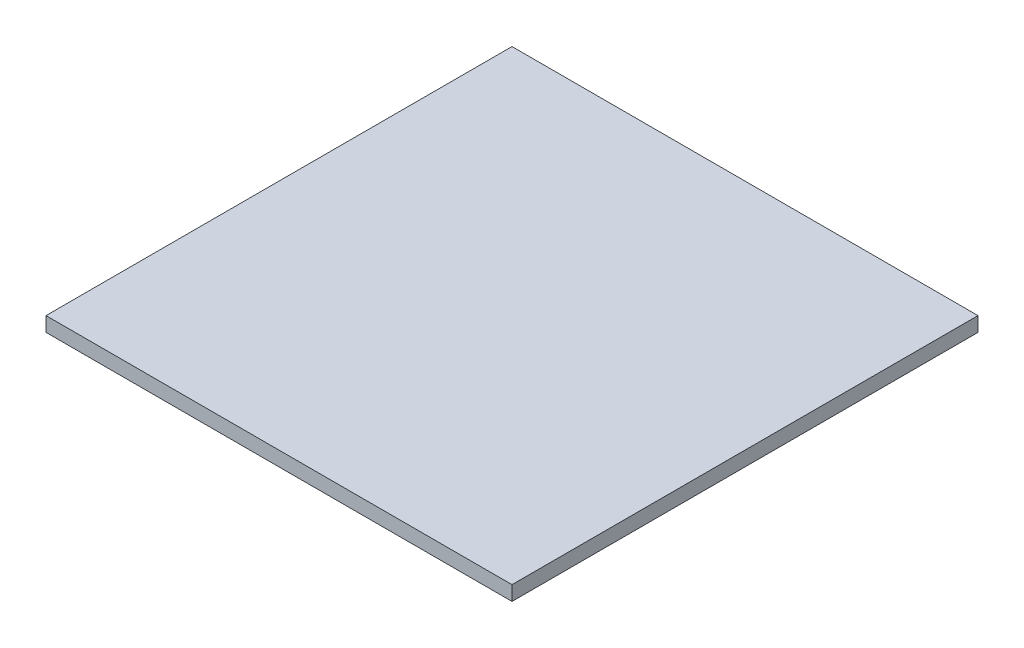
ISO-10303-21;
HEADER;
FILE_DESCRIPTION(('STEP AP214'),'2;1');
FILE_NAME('part.step','',(''),(''),'','','');
FILE_SCHEMA(('AUTOMOTIVE_DESIGN { 1 0 10303 214 1 1 1 1 }'));
ENDSEC;
DATA;
#1=APPLICATION_CONTEXT('core data for automotive mechanical design processes');
#2=APPLICATION_PROTOCOL_DEFINITION('international standard','automotive_design',2000,#1);
#3=PRODUCT_CONTEXT('',#1,'mechanical');
#4=PRODUCT('Part','Part','',(#3));
#5=PRODUCT_RELATED_PRODUCT_CATEGORY('part','',(#4));
#6=PRODUCT_DEFINITION_FORMATION('','',#4);
#7=PRODUCT_DEFINITION_CONTEXT('part definition',#1,'design');
#8=PRODUCT_DEFINITION('design','',#6,#7);
#9=PRODUCT_DEFINITION_SHAPE('','',#8);
#10=(LENGTH_UNIT() NAMED_UNIT(*) SI_UNIT(.MILLI.,.METRE.));
#11=(NAMED_UNIT(*) PLANE_ANGLE_UNIT() SI_UNIT($,.RADIAN.));
#12=(NAMED_UNIT(*) SI_UNIT($,.STERADIAN.) SOLID_ANGLE_UNIT());
#13=UNCERTAINTY_MEASURE_WITH_UNIT(LENGTH_MEASURE(1.E-05),#10,'distance_accuracy_value','');
#14=(GEOMETRIC_REPRESENTATION_CONTEXT(3) GLOBAL_UNCERTAINTY_ASSIGNED_CONTEXT((#13)) GLOBAL_UNIT_ASSIGNED_CONTEXT((#10,
#11,#12)) REPRESENTATION_CONTEXT('',''));
#15=CARTESIAN_POINT('',(0.,0.,0.));
#16=DIRECTION('',(0.,0.,1.));
#17=DIRECTION('',(1.,0.,0.));
#18=AXIS2_PLACEMENT_3D('',#15,#16,#17);
#19=CARTESIAN_POINT('',(0.,2.,64.));
#20=DIRECTION('',(-1.,0.,0.));
#21=DIRECTION('',(0.,0.,1.));
#22=AXIS2_PLACEMENT_3D('',#19,#20,#21);
#23=PLANE('',#22);
#24=DIRECTION('',(0.,0.,-1.));
#25=VECTOR('',#24,1.);
#26=CARTESIAN_POINT('',(0.,0.,64.));
#27=LINE('',#26,#25);
#28=CARTESIAN_POINT('',(0.,0.,64.));
#29=VERTEX_POINT('',#28);
#30=CARTESIAN_POINT('',(0.,0.,0.));
#31=VERTEX_POINT('',#30);
#32=EDGE_CURVE('E109',#29,#31,#27,.T.);
#33=ORIENTED_EDGE('',*,*,#32,.T.);
#34=DIRECTION('',(0.,-1.,0.));
#35=VECTOR('',#34,1.);
#36=CARTESIAN_POINT('',(0.,2.,0.));
#37=LINE('',#36,#35);
#38=CARTESIAN_POINT('',(0.,2.,0.));
#39=VERTEX_POINT('',#38);
#40=EDGE_CURVE('E11',#39,#31,#37,.T.);
#41=ORIENTED_EDGE('',*,*,#40,.F.);
#42=DIRECTION('',(0.,0.,-1.));
#43=VECTOR('',#42,1.);
#44=CARTESIAN_POINT('',(0.,2.,64.));
#45=LINE('',#44,#43);
#46=CARTESIAN_POINT('',(0.,2.,64.));
#47=VERTEX_POINT('',#46);
#48=EDGE_CURVE('E93',#47,#39,#45,.T.);
#49=ORIENTED_EDGE('',*,*,#48,.F.);
#50=DIRECTION('',(0.,-1.,0.));
#51=VECTOR('',#50,1.);
#52=CARTESIAN_POINT('',(0.,2.,64.));
#53=LINE('',#52,#51);
#54=EDGE_CURVE('E105',#47,#29,#53,.T.);
#55=ORIENTED_EDGE('',*,*,#54,.T.);
#56=EDGE_LOOP('',(#33,#41,#49,#55));
#57=FACE_BOUND('',#56,.T.);
#58=ADVANCED_FACE('F41',(#57),#23,.F.);
#59=CARTESIAN_POINT('',(0.,2.,0.));
#60=DIRECTION('',(0.,0.,1.));
#61=DIRECTION('',(1.,0.,0.));
#62=AXIS2_PLACEMENT_3D('',#59,#60,#61);
#63=PLANE('',#62);
#64=DIRECTION('',(-1.,0.,0.));
#65=VECTOR('',#64,1.);
#66=CARTESIAN_POINT('',(0.,0.,0.));
#67=LINE('',#66,#65);
#68=CARTESIAN_POINT('',(-64.,0.,0.));
#69=VERTEX_POINT('',#68);
#70=EDGE_CURVE('E98',#31,#69,#67,.T.);
#71=ORIENTED_EDGE('',*,*,#70,.T.);
#72=DIRECTION('',(0.,-1.,0.));
#73=VECTOR('',#72,1.);
#74=CARTESIAN_POINT('',(-64.,2.,0.));
#75=LINE('',#74,#73);
#76=CARTESIAN_POINT('',(-64.,2.,0.));
#77=VERTEX_POINT('',#76);
#78=EDGE_CURVE('E50',#77,#69,#75,.T.);
#79=ORIENTED_EDGE('',*,*,#78,.F.);
#80=DIRECTION('',(-1.,0.,0.));
#81=VECTOR('',#80,1.);
#82=CARTESIAN_POINT('',(0.,2.,0.));
#83=LINE('',#82,#81);
#84=EDGE_CURVE('E88',#39,#77,#83,.T.);
#85=ORIENTED_EDGE('',*,*,#84,.F.);
#86=ORIENTED_EDGE('',*,*,#40,.T.);
#87=EDGE_LOOP('',(#71,#79,#85,#86));
#88=FACE_BOUND('',#87,.T.);
#89=ADVANCED_FACE('F97',(#88),#63,.F.);
#90=CARTESIAN_POINT('',(-64.,2.,0.));
#91=DIRECTION('',(1.,0.,0.));
#92=DIRECTION('',(0.,0.,-1.));
#93=AXIS2_PLACEMENT_3D('',#90,#91,#92);
#94=PLANE('',#93);
#95=DIRECTION('',(0.,0.,1.));
#96=VECTOR('',#95,1.);
#97=CARTESIAN_POINT('',(-64.,0.,0.));
#98=LINE('',#97,#96);
#99=CARTESIAN_POINT('',(-64.,0.,64.));
#100=VERTEX_POINT('',#99);
#101=EDGE_CURVE('E75',#69,#100,#98,.T.);
#102=ORIENTED_EDGE('',*,*,#101,.T.);
#103=DIRECTION('',(0.,-1.,0.));
#104=VECTOR('',#103,1.);
#105=CARTESIAN_POINT('',(-64.,2.,64.));
#106=LINE('',#105,#104);
#107=CARTESIAN_POINT('',(-64.,2.,64.));
#108=VERTEX_POINT('',#107);
#109=EDGE_CURVE('E100',#108,#100,#106,.T.);
#110=ORIENTED_EDGE('',*,*,#109,.F.);
#111=DIRECTION('',(0.,0.,1.));
#112=VECTOR('',#111,1.);
#113=CARTESIAN_POINT('',(-64.,2.,0.));
#114=LINE('',#113,#112);
#115=EDGE_CURVE('E91',#77,#108,#114,.T.);
#116=ORIENTED_EDGE('',*,*,#115,.F.);
#117=ORIENTED_EDGE('',*,*,#78,.T.);
#118=EDGE_LOOP('',(#102,#110,#116,#117));
#119=FACE_BOUND('',#118,.T.);
#120=ADVANCED_FACE('F101',(#119),#94,.F.);
#121=CARTESIAN_POINT('',(-64.,2.,64.));
#122=DIRECTION('',(0.,0.,-1.));
#123=DIRECTION('',(-1.,0.,0.));
#124=AXIS2_PLACEMENT_3D('',#121,#122,#123);
#125=PLANE('',#124);
#126=DIRECTION('',(1.,0.,0.));
#127=VECTOR('',#126,1.);
#128=CARTESIAN_POINT('',(-64.,0.,64.));
#129=LINE('',#128,#127);
#130=EDGE_CURVE('E81',#100,#29,#129,.T.);
#131=ORIENTED_EDGE('',*,*,#130,.T.);
#132=ORIENTED_EDGE('',*,*,#54,.F.);
#133=DIRECTION('',(1.,0.,0.));
#134=VECTOR('',#133,1.);
#135=CARTESIAN_POINT('',(-64.,2.,64.));
#136=LINE('',#135,#134);
#137=EDGE_CURVE('E58',#108,#47,#136,.T.);
#138=ORIENTED_EDGE('',*,*,#137,.F.);
#139=ORIENTED_EDGE('',*,*,#109,.T.);
#140=EDGE_LOOP('',(#131,#132,#138,#139));
#141=FACE_BOUND('',#140,.T.);
#142=ADVANCED_FACE('F122',(#141),#125,.F.);
#143=CARTESIAN_POINT('',(0.,2.,0.));
#144=DIRECTION('',(0.,1.,0.));
#145=DIRECTION('',(0.,0.,1.));
#146=AXIS2_PLACEMENT_3D('',#143,#144,#145);
#147=PLANE('',#146);
#148=ORIENTED_EDGE('',*,*,#48,.T.);
#149=ORIENTED_EDGE('',*,*,#84,.T.);
#150=ORIENTED_EDGE('',*,*,#115,.T.);
#151=ORIENTED_EDGE('',*,*,#137,.T.);
#152=EDGE_LOOP('',(#148,#149,#150,#151));
#153=FACE_BOUND('',#152,.T.);
#154=ADVANCED_FACE('F89',(#153),#147,.T.);
#155=CARTESIAN_POINT('',(0.,0.,0.));
#156=DIRECTION('',(0.,1.,0.));
#157=DIRECTION('',(0.,0.,1.));
#158=AXIS2_PLACEMENT_3D('',#155,#156,#157);
#159=PLANE('',#158);
#160=ORIENTED_EDGE('',*,*,#32,.F.);
#161=ORIENTED_EDGE('',*,*,#130,.F.);
#162=ORIENTED_EDGE('',*,*,#101,.F.);
#163=ORIENTED_EDGE('',*,*,#70,.F.);
#164=EDGE_LOOP('',(#160,#161,#162,#163));
#165=FACE_BOUND('',#164,.T.);
#166=ADVANCED_FACE('F125',(#165),#159,.F.);
#167=CLOSED_SHELL('',(#58,#89,#120,#142,#154,#166));
#168=MANIFOLD_SOLID_BREP('B2',#167);
#169=ADVANCED_BREP_SHAPE_REPRESENTATION('',(#18,#168),#14);
#170=SHAPE_DEFINITION_REPRESENTATION(#9,#169);
ENDSEC;
END-ISO-10303-21;
